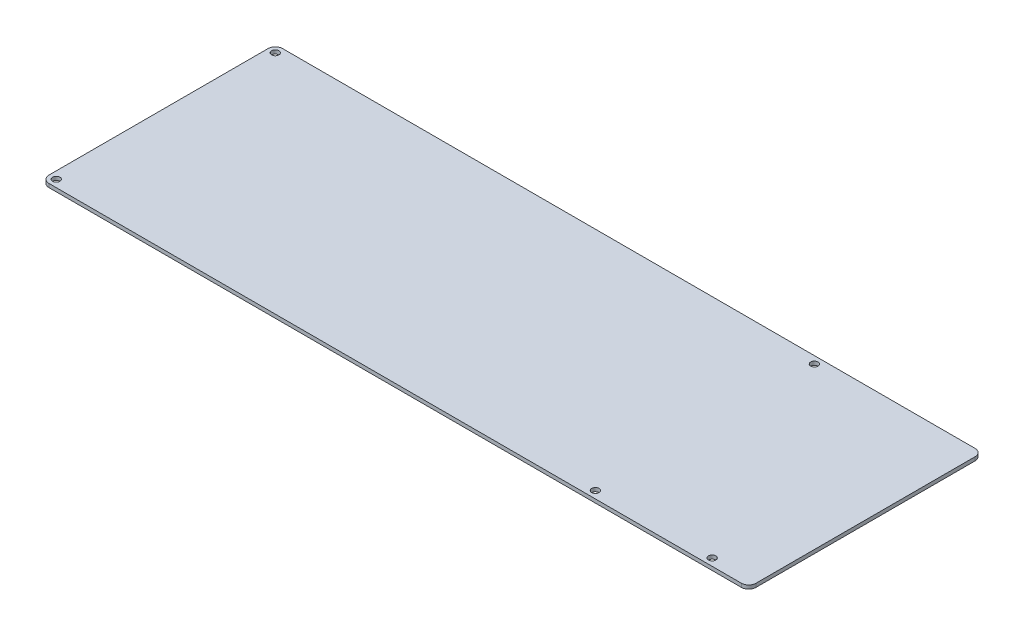
ISO-10303-21;
HEADER;
FILE_DESCRIPTION(('STEP AP214'),'2;1');
FILE_NAME('part.step','',(''),(''),'','','');
FILE_SCHEMA(('AUTOMOTIVE_DESIGN { 1 0 10303 214 1 1 1 1 }'));
ENDSEC;
DATA;
#1=APPLICATION_CONTEXT('core data for automotive mechanical design processes');
#2=APPLICATION_PROTOCOL_DEFINITION('international standard','automotive_design',2000,#1);
#3=PRODUCT_CONTEXT('',#1,'mechanical');
#4=PRODUCT('Part','Part','',(#3));
#5=PRODUCT_RELATED_PRODUCT_CATEGORY('part','',(#4));
#6=PRODUCT_DEFINITION_FORMATION('','',#4);
#7=PRODUCT_DEFINITION_CONTEXT('part definition',#1,'design');
#8=PRODUCT_DEFINITION('design','',#6,#7);
#9=PRODUCT_DEFINITION_SHAPE('','',#8);
#10=(LENGTH_UNIT() NAMED_UNIT(*) SI_UNIT(.MILLI.,.METRE.));
#11=(NAMED_UNIT(*) PLANE_ANGLE_UNIT() SI_UNIT($,.RADIAN.));
#12=(NAMED_UNIT(*) SI_UNIT($,.STERADIAN.) SOLID_ANGLE_UNIT());
#13=UNCERTAINTY_MEASURE_WITH_UNIT(LENGTH_MEASURE(1.E-05),#10,'distance_accuracy_value','');
#14=(GEOMETRIC_REPRESENTATION_CONTEXT(3) GLOBAL_UNCERTAINTY_ASSIGNED_CONTEXT((#13)) GLOBAL_UNIT_ASSIGNED_CONTEXT((#10,
#11,#12)) REPRESENTATION_CONTEXT('',''));
#15=CARTESIAN_POINT('',(0.,0.,0.));
#16=DIRECTION('',(0.,0.,1.));
#17=DIRECTION('',(1.,0.,0.));
#18=AXIS2_PLACEMENT_3D('',#15,#16,#17);
#19=CARTESIAN_POINT('',(0.,-3.175,-65.7566422484608));
#20=DIRECTION('',(0.,0.,1.));
#21=DIRECTION('',(1.,0.,0.));
#22=AXIS2_PLACEMENT_3D('',#19,#20,#21);
#23=PLANE('',#22);
#24=DIRECTION('',(1.,0.,0.));
#25=VECTOR('',#24,1.);
#26=CARTESIAN_POINT('',(0.,-3.175,-65.7566422484608));
#27=LINE('',#26,#25);
#28=CARTESIAN_POINT('',(-648.230055785782,-3.175,-65.7566422484608));
#29=VERTEX_POINT('',#28);
#30=CARTESIAN_POINT('',(-45.9600557857823,-3.175,-65.7566422484608));
#31=VERTEX_POINT('',#30);
#32=EDGE_CURVE('E156',#29,#31,#27,.T.);
#33=ORIENTED_EDGE('',*,*,#32,.T.);
#34=DIRECTION('',(0.,1.,0.));
#35=VECTOR('',#34,1.);
#36=CARTESIAN_POINT('',(-45.9600557857823,-3.175,-65.7566422484608));
#37=LINE('',#36,#35);
#38=CARTESIAN_POINT('',(-45.9600557857823,0.,-65.7566422484608));
#39=VERTEX_POINT('',#38);
#40=EDGE_CURVE('E11',#31,#39,#37,.T.);
#41=ORIENTED_EDGE('',*,*,#40,.T.);
#42=DIRECTION('',(1.,0.,0.));
#43=VECTOR('',#42,1.);
#44=CARTESIAN_POINT('',(0.,0.,-65.7566422484608));
#45=LINE('',#44,#43);
#46=CARTESIAN_POINT('',(-648.230055785782,0.,-65.7566422484608));
#47=VERTEX_POINT('',#46);
#48=EDGE_CURVE('E106',#47,#39,#45,.T.);
#49=ORIENTED_EDGE('',*,*,#48,.F.);
#50=DIRECTION('',(0.,1.,0.));
#51=VECTOR('',#50,1.);
#52=CARTESIAN_POINT('',(-648.230055785782,-3.175,-65.7566422484608));
#53=LINE('',#52,#51);
#54=EDGE_CURVE('E42',#47,#29,#53,.F.);
#55=ORIENTED_EDGE('',*,*,#54,.T.);
#56=EDGE_LOOP('',(#33,#41,#49,#55));
#57=FACE_BOUND('',#56,.T.);
#58=ADVANCED_FACE('F34',(#57),#23,.T.);
#59=CARTESIAN_POINT('',(-654.580055785782,-3.175,0.));
#60=DIRECTION('',(1.,0.,0.));
#61=DIRECTION('',(0.,0.,-1.));
#62=AXIS2_PLACEMENT_3D('',#59,#60,#61);
#63=PLANE('',#62);
#64=DIRECTION('',(0.,0.,-1.));
#65=VECTOR('',#64,1.);
#66=CARTESIAN_POINT('',(-654.580055785782,0.,0.));
#67=LINE('',#66,#65);
#68=CARTESIAN_POINT('',(-654.580055785782,0.,-72.1066422484608));
#69=VERTEX_POINT('',#68);
#70=CARTESIAN_POINT('',(-654.580055785782,0.,-262.606642248461));
#71=VERTEX_POINT('',#70);
#72=EDGE_CURVE('E132',#69,#71,#67,.T.);
#73=ORIENTED_EDGE('',*,*,#72,.T.);
#74=DIRECTION('',(0.,1.,0.));
#75=VECTOR('',#74,1.);
#76=CARTESIAN_POINT('',(-654.580055785782,-3.175,-262.606642248461));
#77=LINE('',#76,#75);
#78=CARTESIAN_POINT('',(-654.580055785782,-3.175,-262.606642248461));
#79=VERTEX_POINT('',#78);
#80=EDGE_CURVE('E49',#71,#79,#77,.F.);
#81=ORIENTED_EDGE('',*,*,#80,.T.);
#82=DIRECTION('',(0.,0.,-1.));
#83=VECTOR('',#82,1.);
#84=CARTESIAN_POINT('',(-654.580055785782,-3.175,0.));
#85=LINE('',#84,#83);
#86=CARTESIAN_POINT('',(-654.580055785782,-3.175,-72.1066422484608));
#87=VERTEX_POINT('',#86);
#88=EDGE_CURVE('E126',#87,#79,#85,.T.);
#89=ORIENTED_EDGE('',*,*,#88,.F.);
#90=DIRECTION('',(0.,1.,0.));
#91=VECTOR('',#90,1.);
#92=CARTESIAN_POINT('',(-654.580055785782,0.,-72.1066422484608));
#93=LINE('',#92,#91);
#94=EDGE_CURVE('E150',#87,#69,#93,.T.);
#95=ORIENTED_EDGE('',*,*,#94,.T.);
#96=EDGE_LOOP('',(#73,#81,#89,#95));
#97=FACE_BOUND('',#96,.T.);
#98=ADVANCED_FACE('F165',(#97),#63,.F.);
#99=CARTESIAN_POINT('',(0.,-3.175,-268.956642248461));
#100=DIRECTION('',(0.,0.,1.));
#101=DIRECTION('',(1.,0.,0.));
#102=AXIS2_PLACEMENT_3D('',#99,#100,#101);
#103=PLANE('',#102);
#104=DIRECTION('',(1.,0.,0.));
#105=VECTOR('',#104,1.);
#106=CARTESIAN_POINT('',(0.,0.,-268.956642248461));
#107=LINE('',#106,#105);
#108=CARTESIAN_POINT('',(-648.230055785782,0.,-268.956642248461));
#109=VERTEX_POINT('',#108);
#110=CARTESIAN_POINT('',(-45.9600557857823,0.,-268.956642248461));
#111=VERTEX_POINT('',#110);
#112=EDGE_CURVE('E121',#109,#111,#107,.T.);
#113=ORIENTED_EDGE('',*,*,#112,.T.);
#114=DIRECTION('',(0.,1.,0.));
#115=VECTOR('',#114,1.);
#116=CARTESIAN_POINT('',(-45.9600557857823,-3.175,-268.956642248461));
#117=LINE('',#116,#115);
#118=CARTESIAN_POINT('',(-45.9600557857823,-3.175,-268.956642248461));
#119=VERTEX_POINT('',#118);
#120=EDGE_CURVE('E142',#111,#119,#117,.F.);
#121=ORIENTED_EDGE('',*,*,#120,.T.);
#122=DIRECTION('',(1.,0.,0.));
#123=VECTOR('',#122,1.);
#124=CARTESIAN_POINT('',(0.,-3.175,-268.956642248461));
#125=LINE('',#124,#123);
#126=CARTESIAN_POINT('',(-648.230055785782,-3.175,-268.956642248461));
#127=VERTEX_POINT('',#126);
#128=EDGE_CURVE('E129',#127,#119,#125,.T.);
#129=ORIENTED_EDGE('',*,*,#128,.F.);
#130=DIRECTION('',(0.,1.,0.));
#131=VECTOR('',#130,1.);
#132=CARTESIAN_POINT('',(-648.230055785782,-3.175,-268.956642248461));
#133=LINE('',#132,#131);
#134=EDGE_CURVE('E139',#127,#109,#133,.T.);
#135=ORIENTED_EDGE('',*,*,#134,.T.);
#136=EDGE_LOOP('',(#113,#121,#129,#135));
#137=FACE_BOUND('',#136,.T.);
#138=ADVANCED_FACE('F228',(#137),#103,.F.);
#139=CARTESIAN_POINT('',(-648.230055785783,-3.175,-262.606642248461));
#140=DIRECTION('',(0.,1.,0.));
#141=DIRECTION('',(0.,0.,1.));
#142=AXIS2_PLACEMENT_3D('',#139,#140,#141);
#143=CYLINDRICAL_SURFACE('',#142,3.17500000000008);
#144=CARTESIAN_POINT('',(-648.230055785783,-3.175,-262.606642248461));
#145=DIRECTION('',(0.,1.,0.));
#146=DIRECTION('',(0.,0.,1.));
#147=AXIS2_PLACEMENT_3D('',#144,#145,#146);
#148=CIRCLE('',#147,3.17500000000008);
#149=CARTESIAN_POINT('',(-648.230055785783,-3.175,-259.431642248461));
#150=VERTEX_POINT('',#149);
#151=EDGE_CURVE('E161',#150,#150,#148,.T.);
#152=ORIENTED_EDGE('',*,*,#151,.F.);
#153=EDGE_LOOP('',(#152));
#154=FACE_BOUND('',#153,.T.);
#155=CARTESIAN_POINT('',(-648.230055785783,0.,-262.606642248461));
#156=DIRECTION('',(0.,1.,0.));
#157=DIRECTION('',(0.,0.,1.));
#158=AXIS2_PLACEMENT_3D('',#155,#156,#157);
#159=CIRCLE('',#158,3.17500000000008);
#160=CARTESIAN_POINT('',(-648.230055785783,0.,-259.431642248461));
#161=VERTEX_POINT('',#160);
#162=EDGE_CURVE('E176',#161,#161,#159,.T.);
#163=ORIENTED_EDGE('',*,*,#162,.T.);
#164=EDGE_LOOP('',(#163));
#165=FACE_BOUND('',#164,.T.);
#166=ADVANCED_FACE('F225',(#154,#165),#143,.F.);
#167=CARTESIAN_POINT('',(-648.230055785783,-3.175,-72.1066422484608));
#168=DIRECTION('',(0.,1.,0.));
#169=DIRECTION('',(0.,0.,1.));
#170=AXIS2_PLACEMENT_3D('',#167,#168,#169);
#171=CYLINDRICAL_SURFACE('',#170,3.17500000000008);
#172=CARTESIAN_POINT('',(-648.230055785783,-3.175,-72.1066422484608));
#173=DIRECTION('',(0.,1.,0.));
#174=DIRECTION('',(0.,0.,1.));
#175=AXIS2_PLACEMENT_3D('',#172,#173,#174);
#176=CIRCLE('',#175,3.17500000000008);
#177=CARTESIAN_POINT('',(-648.230055785783,-3.175,-68.9316422484607));
#178=VERTEX_POINT('',#177);
#179=EDGE_CURVE('E195',#178,#178,#176,.T.);
#180=ORIENTED_EDGE('',*,*,#179,.F.);
#181=EDGE_LOOP('',(#180));
#182=FACE_BOUND('',#181,.T.);
#183=CARTESIAN_POINT('',(-648.230055785783,0.,-72.1066422484608));
#184=DIRECTION('',(0.,1.,0.));
#185=DIRECTION('',(0.,0.,1.));
#186=AXIS2_PLACEMENT_3D('',#183,#184,#185);
#187=CIRCLE('',#186,3.17500000000008);
#188=CARTESIAN_POINT('',(-648.230055785783,0.,-68.9316422484607));
#189=VERTEX_POINT('',#188);
#190=EDGE_CURVE('E179',#189,#189,#187,.T.);
#191=ORIENTED_EDGE('',*,*,#190,.T.);
#192=EDGE_LOOP('',(#191));
#193=FACE_BOUND('',#192,.T.);
#194=ADVANCED_FACE('F227',(#182,#193),#171,.F.);
#195=CARTESIAN_POINT('',(-179.310055785782,-3.175,-72.1066422484608));
#196=DIRECTION('',(0.,1.,0.));
#197=DIRECTION('',(0.,0.,1.));
#198=AXIS2_PLACEMENT_3D('',#195,#196,#197);
#199=CYLINDRICAL_SURFACE('',#198,3.17499999999997);
#200=CARTESIAN_POINT('',(-179.310055785782,-3.175,-72.1066422484608));
#201=DIRECTION('',(0.,1.,0.));
#202=DIRECTION('',(0.,0.,1.));
#203=AXIS2_PLACEMENT_3D('',#200,#201,#202);
#204=CIRCLE('',#203,3.17499999999997);
#205=CARTESIAN_POINT('',(-179.310055785782,-3.175,-68.9316422484608));
#206=VERTEX_POINT('',#205);
#207=EDGE_CURVE('E198',#206,#206,#204,.T.);
#208=ORIENTED_EDGE('',*,*,#207,.F.);
#209=EDGE_LOOP('',(#208));
#210=FACE_BOUND('',#209,.T.);
#211=CARTESIAN_POINT('',(-179.310055785782,0.,-72.1066422484608));
#212=DIRECTION('',(0.,1.,0.));
#213=DIRECTION('',(0.,0.,1.));
#214=AXIS2_PLACEMENT_3D('',#211,#212,#213);
#215=CIRCLE('',#214,3.17499999999997);
#216=CARTESIAN_POINT('',(-179.310055785782,0.,-68.9316422484608));
#217=VERTEX_POINT('',#216);
#218=EDGE_CURVE('E182',#217,#217,#215,.T.);
#219=ORIENTED_EDGE('',*,*,#218,.T.);
#220=EDGE_LOOP('',(#219));
#221=FACE_BOUND('',#220,.T.);
#222=ADVANCED_FACE('F210',(#210,#221),#199,.F.);
#223=CARTESIAN_POINT('',(-179.310055785782,-3.175,-262.606642248461));
#224=DIRECTION('',(0.,1.,0.));
#225=DIRECTION('',(0.,0.,1.));
#226=AXIS2_PLACEMENT_3D('',#223,#224,#225);
#227=CYLINDRICAL_SURFACE('',#226,3.175);
#228=CARTESIAN_POINT('',(-179.310055785782,-3.175,-262.606642248461));
#229=DIRECTION('',(0.,1.,0.));
#230=DIRECTION('',(0.,0.,1.));
#231=AXIS2_PLACEMENT_3D('',#228,#229,#230);
#232=CIRCLE('',#231,3.175);
#233=CARTESIAN_POINT('',(-179.310055785782,-3.175,-259.431642248461));
#234=VERTEX_POINT('',#233);
#235=EDGE_CURVE('E169',#234,#234,#232,.T.);
#236=ORIENTED_EDGE('',*,*,#235,.F.);
#237=EDGE_LOOP('',(#236));
#238=FACE_BOUND('',#237,.T.);
#239=CARTESIAN_POINT('',(-179.310055785782,0.,-262.606642248461));
#240=DIRECTION('',(0.,1.,0.));
#241=DIRECTION('',(0.,0.,1.));
#242=AXIS2_PLACEMENT_3D('',#239,#240,#241);
#243=CIRCLE('',#242,3.175);
#244=CARTESIAN_POINT('',(-179.310055785782,0.,-259.431642248461));
#245=VERTEX_POINT('',#244);
#246=EDGE_CURVE('E185',#245,#245,#243,.T.);
#247=ORIENTED_EDGE('',*,*,#246,.T.);
#248=EDGE_LOOP('',(#247));
#249=FACE_BOUND('',#248,.T.);
#250=ADVANCED_FACE('F206',(#238,#249),#227,.F.);
#251=CARTESIAN_POINT('',(-77.7100557857826,-3.175,-72.1066422484608));
#252=DIRECTION('',(0.,1.,0.));
#253=DIRECTION('',(0.,0.,1.));
#254=AXIS2_PLACEMENT_3D('',#251,#252,#253);
#255=CYLINDRICAL_SURFACE('',#254,3.175);
#256=CARTESIAN_POINT('',(-77.7100557857826,-3.175,-72.1066422484608));
#257=DIRECTION('',(0.,1.,0.));
#258=DIRECTION('',(0.,0.,1.));
#259=AXIS2_PLACEMENT_3D('',#256,#257,#258);
#260=CIRCLE('',#259,3.175);
#261=CARTESIAN_POINT('',(-77.7100557857826,-3.175,-68.9316422484608));
#262=VERTEX_POINT('',#261);
#263=EDGE_CURVE('E167',#262,#262,#260,.T.);
#264=ORIENTED_EDGE('',*,*,#263,.F.);
#265=EDGE_LOOP('',(#264));
#266=FACE_BOUND('',#265,.T.);
#267=CARTESIAN_POINT('',(-77.7100557857826,0.,-72.1066422484608));
#268=DIRECTION('',(0.,1.,0.));
#269=DIRECTION('',(0.,0.,1.));
#270=AXIS2_PLACEMENT_3D('',#267,#268,#269);
#271=CIRCLE('',#270,3.175);
#272=CARTESIAN_POINT('',(-77.7100557857826,0.,-68.9316422484608));
#273=VERTEX_POINT('',#272);
#274=EDGE_CURVE('E188',#273,#273,#271,.T.);
#275=ORIENTED_EDGE('',*,*,#274,.T.);
#276=EDGE_LOOP('',(#275));
#277=FACE_BOUND('',#276,.T.);
#278=ADVANCED_FACE('F209',(#266,#277),#255,.F.);
#279=CARTESIAN_POINT('',(-39.6100557857823,-3.175,0.));
#280=DIRECTION('',(1.,0.,0.));
#281=DIRECTION('',(0.,0.,-1.));
#282=AXIS2_PLACEMENT_3D('',#279,#280,#281);
#283=PLANE('',#282);
#284=DIRECTION('',(0.,0.,-1.));
#285=VECTOR('',#284,1.);
#286=CARTESIAN_POINT('',(-39.6100557857823,-3.175,0.));
#287=LINE('',#286,#285);
#288=CARTESIAN_POINT('',(-39.6100557857823,-3.175,-72.1066422484608));
#289=VERTEX_POINT('',#288);
#290=CARTESIAN_POINT('',(-39.6100557857823,-3.175,-262.606642248461));
#291=VERTEX_POINT('',#290);
#292=EDGE_CURVE('E160',#289,#291,#287,.T.);
#293=ORIENTED_EDGE('',*,*,#292,.T.);
#294=DIRECTION('',(0.,1.,0.));
#295=VECTOR('',#294,1.);
#296=CARTESIAN_POINT('',(-39.6100557857823,0.,-262.606642248461));
#297=LINE('',#296,#295);
#298=CARTESIAN_POINT('',(-39.6100557857823,0.,-262.606642248461));
#299=VERTEX_POINT('',#298);
#300=EDGE_CURVE('E120',#291,#299,#297,.T.);
#301=ORIENTED_EDGE('',*,*,#300,.T.);
#302=DIRECTION('',(0.,0.,-1.));
#303=VECTOR('',#302,1.);
#304=CARTESIAN_POINT('',(-39.6100557857823,0.,0.));
#305=LINE('',#304,#303);
#306=CARTESIAN_POINT('',(-39.6100557857823,0.,-72.1066422484608));
#307=VERTEX_POINT('',#306);
#308=EDGE_CURVE('E104',#307,#299,#305,.T.);
#309=ORIENTED_EDGE('',*,*,#308,.F.);
#310=DIRECTION('',(0.,1.,0.));
#311=VECTOR('',#310,1.);
#312=CARTESIAN_POINT('',(-39.6100557857823,-3.175,-72.1066422484608));
#313=LINE('',#312,#311);
#314=EDGE_CURVE('E117',#307,#289,#313,.F.);
#315=ORIENTED_EDGE('',*,*,#314,.T.);
#316=EDGE_LOOP('',(#293,#301,#309,#315));
#317=FACE_BOUND('',#316,.T.);
#318=ADVANCED_FACE('F116',(#317),#283,.T.);
#319=CARTESIAN_POINT('',(0.,-3.175,0.));
#320=DIRECTION('',(0.,1.,0.));
#321=DIRECTION('',(0.,0.,1.));
#322=AXIS2_PLACEMENT_3D('',#319,#320,#321);
#323=PLANE('',#322);
#324=ORIENTED_EDGE('',*,*,#263,.T.);
#325=EDGE_LOOP('',(#324));
#326=FACE_BOUND('',#325,.T.);
#327=ORIENTED_EDGE('',*,*,#235,.T.);
#328=EDGE_LOOP('',(#327));
#329=FACE_BOUND('',#328,.T.);
#330=ORIENTED_EDGE('',*,*,#207,.T.);
#331=EDGE_LOOP('',(#330));
#332=FACE_BOUND('',#331,.T.);
#333=ORIENTED_EDGE('',*,*,#179,.T.);
#334=EDGE_LOOP('',(#333));
#335=FACE_BOUND('',#334,.T.);
#336=ORIENTED_EDGE('',*,*,#151,.T.);
#337=EDGE_LOOP('',(#336));
#338=FACE_BOUND('',#337,.T.);
#339=ORIENTED_EDGE('',*,*,#128,.T.);
#340=CARTESIAN_POINT('',(-45.9600557857823,-3.175,-262.606642248461));
#341=DIRECTION('',(0.,1.,0.));
#342=DIRECTION('',(0.,0.,1.));
#343=AXIS2_PLACEMENT_3D('',#340,#341,#342);
#344=CIRCLE('',#343,6.35);
#345=EDGE_CURVE('E148',#119,#291,#344,.F.);
#346=ORIENTED_EDGE('',*,*,#345,.T.);
#347=ORIENTED_EDGE('',*,*,#292,.F.);
#348=CARTESIAN_POINT('',(-45.9600557857823,-3.175,-72.1066422484608));
#349=DIRECTION('',(0.,1.,0.));
#350=DIRECTION('',(0.,0.,1.));
#351=AXIS2_PLACEMENT_3D('',#348,#349,#350);
#352=CIRCLE('',#351,6.35);
#353=EDGE_CURVE('E125',#289,#31,#352,.F.);
#354=ORIENTED_EDGE('',*,*,#353,.T.);
#355=ORIENTED_EDGE('',*,*,#32,.F.);
#356=CARTESIAN_POINT('',(-648.230055785782,-3.175,-72.1066422484608));
#357=DIRECTION('',(0.,1.,0.));
#358=DIRECTION('',(0.,0.,1.));
#359=AXIS2_PLACEMENT_3D('',#356,#357,#358);
#360=CIRCLE('',#359,6.35);
#361=EDGE_CURVE('E56',#29,#87,#360,.F.);
#362=ORIENTED_EDGE('',*,*,#361,.T.);
#363=ORIENTED_EDGE('',*,*,#88,.T.);
#364=CARTESIAN_POINT('',(-648.230055785782,-3.175,-262.606642248461));
#365=DIRECTION('',(0.,1.,0.));
#366=DIRECTION('',(0.,0.,1.));
#367=AXIS2_PLACEMENT_3D('',#364,#365,#366);
#368=CIRCLE('',#367,6.35);
#369=EDGE_CURVE('E146',#79,#127,#368,.F.);
#370=ORIENTED_EDGE('',*,*,#369,.T.);
#371=EDGE_LOOP('',(#339,#346,#347,#354,#355,#362,#363,#370));
#372=FACE_BOUND('',#371,.T.);
#373=ADVANCED_FACE('F159',(#326,#329,#332,#335,#338,#372),#323,.F.);
#374=CARTESIAN_POINT('',(0.,0.,0.));
#375=DIRECTION('',(0.,1.,0.));
#376=DIRECTION('',(0.,0.,1.));
#377=AXIS2_PLACEMENT_3D('',#374,#375,#376);
#378=PLANE('',#377);
#379=ORIENTED_EDGE('',*,*,#274,.F.);
#380=EDGE_LOOP('',(#379));
#381=FACE_BOUND('',#380,.T.);
#382=ORIENTED_EDGE('',*,*,#246,.F.);
#383=EDGE_LOOP('',(#382));
#384=FACE_BOUND('',#383,.T.);
#385=ORIENTED_EDGE('',*,*,#218,.F.);
#386=EDGE_LOOP('',(#385));
#387=FACE_BOUND('',#386,.T.);
#388=ORIENTED_EDGE('',*,*,#190,.F.);
#389=EDGE_LOOP('',(#388));
#390=FACE_BOUND('',#389,.T.);
#391=ORIENTED_EDGE('',*,*,#162,.F.);
#392=EDGE_LOOP('',(#391));
#393=FACE_BOUND('',#392,.T.);
#394=ORIENTED_EDGE('',*,*,#308,.T.);
#395=CARTESIAN_POINT('',(-45.9600557857823,0.,-262.606642248461));
#396=DIRECTION('',(0.,1.,0.));
#397=DIRECTION('',(0.,0.,1.));
#398=AXIS2_PLACEMENT_3D('',#395,#396,#397);
#399=CIRCLE('',#398,6.35);
#400=EDGE_CURVE('E137',#299,#111,#399,.T.);
#401=ORIENTED_EDGE('',*,*,#400,.T.);
#402=ORIENTED_EDGE('',*,*,#112,.F.);
#403=CARTESIAN_POINT('',(-648.230055785782,0.,-262.606642248461));
#404=DIRECTION('',(0.,1.,0.));
#405=DIRECTION('',(0.,0.,1.));
#406=AXIS2_PLACEMENT_3D('',#403,#404,#405);
#407=CIRCLE('',#406,6.35);
#408=EDGE_CURVE('E110',#109,#71,#407,.T.);
#409=ORIENTED_EDGE('',*,*,#408,.T.);
#410=ORIENTED_EDGE('',*,*,#72,.F.);
#411=CARTESIAN_POINT('',(-648.230055785782,0.,-72.1066422484608));
#412=DIRECTION('',(0.,1.,0.));
#413=DIRECTION('',(0.,0.,1.));
#414=AXIS2_PLACEMENT_3D('',#411,#412,#413);
#415=CIRCLE('',#414,6.35);
#416=EDGE_CURVE('E111',#69,#47,#415,.T.);
#417=ORIENTED_EDGE('',*,*,#416,.T.);
#418=ORIENTED_EDGE('',*,*,#48,.T.);
#419=CARTESIAN_POINT('',(-45.9600557857823,0.,-72.1066422484608));
#420=DIRECTION('',(0.,1.,0.));
#421=DIRECTION('',(0.,0.,1.));
#422=AXIS2_PLACEMENT_3D('',#419,#420,#421);
#423=CIRCLE('',#422,6.35);
#424=EDGE_CURVE('E101',#39,#307,#423,.T.);
#425=ORIENTED_EDGE('',*,*,#424,.T.);
#426=EDGE_LOOP('',(#394,#401,#402,#409,#410,#417,#418,#425));
#427=FACE_BOUND('',#426,.T.);
#428=ADVANCED_FACE('F103',(#381,#384,#387,#390,#393,#427),#378,.T.);
#429=CARTESIAN_POINT('',(-45.9600557857823,-3.175,-262.606642248461));
#430=DIRECTION('',(0.,-1.,0.));
#431=DIRECTION('',(0.,0.,-1.));
#432=AXIS2_PLACEMENT_3D('',#429,#430,#431);
#433=CYLINDRICAL_SURFACE('',#432,6.35);
#434=ORIENTED_EDGE('',*,*,#345,.F.);
#435=ORIENTED_EDGE('',*,*,#120,.F.);
#436=ORIENTED_EDGE('',*,*,#400,.F.);
#437=ORIENTED_EDGE('',*,*,#300,.F.);
#438=EDGE_LOOP('',(#434,#435,#436,#437));
#439=FACE_BOUND('',#438,.T.);
#440=ADVANCED_FACE('F216',(#439),#433,.T.);
#441=CARTESIAN_POINT('',(-648.230055785782,-3.175,-262.606642248461));
#442=DIRECTION('',(0.,1.,0.));
#443=DIRECTION('',(0.,0.,1.));
#444=AXIS2_PLACEMENT_3D('',#441,#442,#443);
#445=CYLINDRICAL_SURFACE('',#444,6.35);
#446=ORIENTED_EDGE('',*,*,#369,.F.);
#447=ORIENTED_EDGE('',*,*,#80,.F.);
#448=ORIENTED_EDGE('',*,*,#408,.F.);
#449=ORIENTED_EDGE('',*,*,#134,.F.);
#450=EDGE_LOOP('',(#446,#447,#448,#449));
#451=FACE_BOUND('',#450,.T.);
#452=ADVANCED_FACE('F264',(#451),#445,.T.);
#453=CARTESIAN_POINT('',(-45.9600557857823,-3.175,-72.1066422484608));
#454=DIRECTION('',(0.,1.,0.));
#455=DIRECTION('',(0.,0.,1.));
#456=AXIS2_PLACEMENT_3D('',#453,#454,#455);
#457=CYLINDRICAL_SURFACE('',#456,6.35);
#458=ORIENTED_EDGE('',*,*,#353,.F.);
#459=ORIENTED_EDGE('',*,*,#314,.F.);
#460=ORIENTED_EDGE('',*,*,#424,.F.);
#461=ORIENTED_EDGE('',*,*,#40,.F.);
#462=EDGE_LOOP('',(#458,#459,#460,#461));
#463=FACE_BOUND('',#462,.T.);
#464=ADVANCED_FACE('F124',(#463),#457,.T.);
#465=CARTESIAN_POINT('',(-648.230055785782,-3.175,-72.1066422484608));
#466=DIRECTION('',(0.,-1.,0.));
#467=DIRECTION('',(0.,0.,-1.));
#468=AXIS2_PLACEMENT_3D('',#465,#466,#467);
#469=CYLINDRICAL_SURFACE('',#468,6.35);
#470=ORIENTED_EDGE('',*,*,#361,.F.);
#471=ORIENTED_EDGE('',*,*,#54,.F.);
#472=ORIENTED_EDGE('',*,*,#416,.F.);
#473=ORIENTED_EDGE('',*,*,#94,.F.);
#474=EDGE_LOOP('',(#470,#471,#472,#473));
#475=FACE_BOUND('',#474,.T.);
#476=ADVANCED_FACE('F36',(#475),#469,.T.);
#477=CLOSED_SHELL('',(#58,#98,#138,#166,#194,#222,#250,#278,#318,#373,#428,#440,#452,#464,#476));
#478=MANIFOLD_SOLID_BREP('B2',#477);
#479=ADVANCED_BREP_SHAPE_REPRESENTATION('',(#18,#478),#14);
#480=SHAPE_DEFINITION_REPRESENTATION(#9,#479);
ENDSEC;
END-ISO-10303-21;
